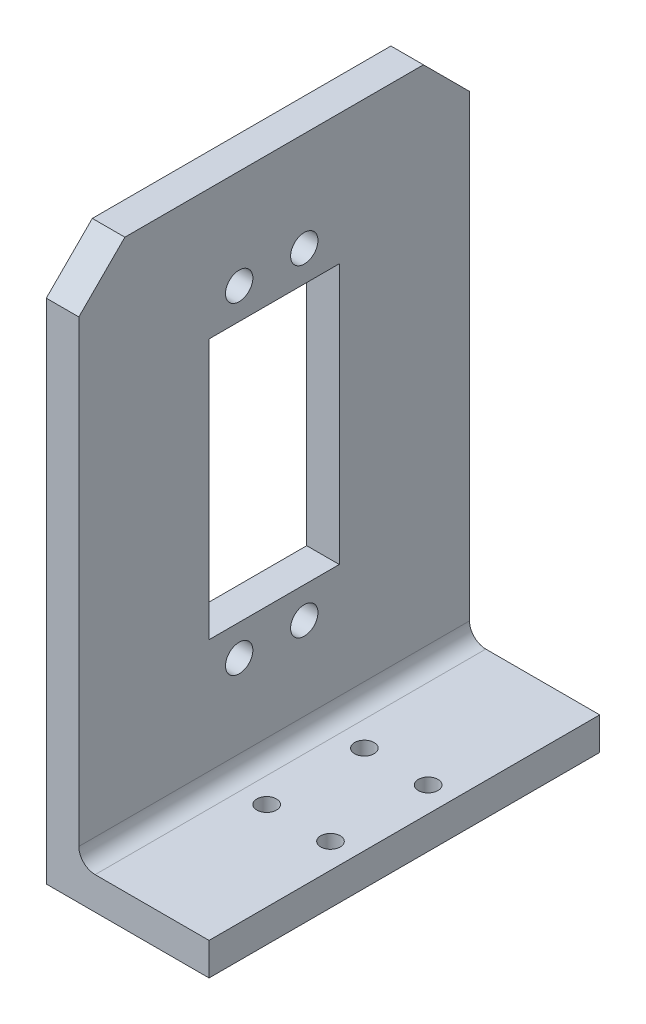
ISO-10303-21;
HEADER;
FILE_DESCRIPTION(('STEP AP214'),'2;1');
FILE_NAME('part.step','',(''),(''),'','','');
FILE_SCHEMA(('AUTOMOTIVE_DESIGN { 1 0 10303 214 1 1 1 1 }'));
ENDSEC;
DATA;
#1=APPLICATION_CONTEXT('core data for automotive mechanical design processes');
#2=APPLICATION_PROTOCOL_DEFINITION('international standard','automotive_design',2000,#1);
#3=PRODUCT_CONTEXT('',#1,'mechanical');
#4=PRODUCT('Part','Part','',(#3));
#5=PRODUCT_RELATED_PRODUCT_CATEGORY('part','',(#4));
#6=PRODUCT_DEFINITION_FORMATION('','',#4);
#7=PRODUCT_DEFINITION_CONTEXT('part definition',#1,'design');
#8=PRODUCT_DEFINITION('design','',#6,#7);
#9=PRODUCT_DEFINITION_SHAPE('','',#8);
#10=(LENGTH_UNIT() NAMED_UNIT(*) SI_UNIT(.MILLI.,.METRE.));
#11=(NAMED_UNIT(*) PLANE_ANGLE_UNIT() SI_UNIT($,.RADIAN.));
#12=(NAMED_UNIT(*) SI_UNIT($,.STERADIAN.) SOLID_ANGLE_UNIT());
#13=UNCERTAINTY_MEASURE_WITH_UNIT(LENGTH_MEASURE(1.E-05),#10,'distance_accuracy_value','');
#14=(GEOMETRIC_REPRESENTATION_CONTEXT(3) GLOBAL_UNCERTAINTY_ASSIGNED_CONTEXT((#13)) GLOBAL_UNIT_ASSIGNED_CONTEXT((#10,
#11,#12)) REPRESENTATION_CONTEXT('',''));
#15=CARTESIAN_POINT('',(0.,0.,0.));
#16=DIRECTION('',(0.,0.,1.));
#17=DIRECTION('',(1.,0.,0.));
#18=AXIS2_PLACEMENT_3D('',#15,#16,#17);
#19=CARTESIAN_POINT('',(12.5,5.,-30.));
#20=DIRECTION('',(-1.,0.,0.));
#21=DIRECTION('',(0.,0.,1.));
#22=AXIS2_PLACEMENT_3D('',#19,#20,#21);
#23=PLANE('',#22);
#24=DIRECTION('',(0.,0.,-1.));
#25=VECTOR('',#24,1.);
#26=CARTESIAN_POINT('',(12.5,0.,-30.));
#27=LINE('',#26,#25);
#28=CARTESIAN_POINT('',(12.5,0.,30.));
#29=VERTEX_POINT('',#28);
#30=CARTESIAN_POINT('',(12.5,0.,-30.));
#31=VERTEX_POINT('',#30);
#32=EDGE_CURVE('E162',#29,#31,#27,.T.);
#33=ORIENTED_EDGE('',*,*,#32,.T.);
#34=DIRECTION('',(0.,-1.,0.));
#35=VECTOR('',#34,1.);
#36=CARTESIAN_POINT('',(12.5,5.,-30.));
#37=LINE('',#36,#35);
#38=CARTESIAN_POINT('',(12.5,5.,-30.));
#39=VERTEX_POINT('',#38);
#40=EDGE_CURVE('E187',#39,#31,#37,.T.);
#41=ORIENTED_EDGE('',*,*,#40,.F.);
#42=DIRECTION('',(0.,0.,-1.));
#43=VECTOR('',#42,1.);
#44=CARTESIAN_POINT('',(12.5,5.,-30.));
#45=LINE('',#44,#43);
#46=CARTESIAN_POINT('',(12.5,5.,30.));
#47=VERTEX_POINT('',#46);
#48=EDGE_CURVE('E163',#47,#39,#45,.T.);
#49=ORIENTED_EDGE('',*,*,#48,.F.);
#50=DIRECTION('',(0.,-1.,0.));
#51=VECTOR('',#50,1.);
#52=CARTESIAN_POINT('',(12.5,5.,30.));
#53=LINE('',#52,#51);
#54=EDGE_CURVE('E171',#47,#29,#53,.T.);
#55=ORIENTED_EDGE('',*,*,#54,.T.);
#56=EDGE_LOOP('',(#33,#41,#49,#55));
#57=FACE_BOUND('',#56,.T.);
#58=ADVANCED_FACE('F35',(#57),#23,.F.);
#59=CARTESIAN_POINT('',(-12.5,5.,-30.));
#60=DIRECTION('',(0.,0.,1.));
#61=DIRECTION('',(1.,0.,0.));
#62=AXIS2_PLACEMENT_3D('',#59,#60,#61);
#63=PLANE('',#62);
#64=DIRECTION('',(0.,-1.,0.));
#65=VECTOR('',#64,1.);
#66=CARTESIAN_POINT('',(-12.5,5.,-30.));
#67=LINE('',#66,#65);
#68=CARTESIAN_POINT('',(-12.5,77.9289321881345,-30.));
#69=VERTEX_POINT('',#68);
#70=CARTESIAN_POINT('',(-12.5,0.,-30.));
#71=VERTEX_POINT('',#70);
#72=EDGE_CURVE('E185',#69,#71,#67,.T.);
#73=ORIENTED_EDGE('',*,*,#72,.F.);
#74=DIRECTION('',(1.,0.,0.));
#75=VECTOR('',#74,1.);
#76=CARTESIAN_POINT('',(-12.501,77.9289321881345,-30.));
#77=LINE('',#76,#75);
#78=CARTESIAN_POINT('',(-7.5,77.9289321881345,-30.));
#79=VERTEX_POINT('',#78);
#80=EDGE_CURVE('E138',#69,#79,#77,.T.);
#81=ORIENTED_EDGE('',*,*,#80,.T.);
#82=DIRECTION('',(0.,-1.,0.));
#83=VECTOR('',#82,1.);
#84=CARTESIAN_POINT('',(-7.5,85.,-30.));
#85=LINE('',#84,#83);
#86=CARTESIAN_POINT('',(-7.5,7.49999999999999,-30.));
#87=VERTEX_POINT('',#86);
#88=EDGE_CURVE('E148',#79,#87,#85,.T.);
#89=ORIENTED_EDGE('',*,*,#88,.T.);
#90=CARTESIAN_POINT('',(-5.,7.49999999999999,-30.));
#91=DIRECTION('',(0.,0.,1.));
#92=DIRECTION('',(1.,0.,0.));
#93=AXIS2_PLACEMENT_3D('',#90,#91,#92);
#94=CIRCLE('',#93,2.5);
#95=CARTESIAN_POINT('',(-5.,5.,-30.));
#96=VERTEX_POINT('',#95);
#97=EDGE_CURVE('E43',#87,#96,#94,.T.);
#98=ORIENTED_EDGE('',*,*,#97,.T.);
#99=DIRECTION('',(-1.,0.,0.));
#100=VECTOR('',#99,1.);
#101=CARTESIAN_POINT('',(-12.5,5.,-30.));
#102=LINE('',#101,#100);
#103=EDGE_CURVE('E166',#39,#96,#102,.T.);
#104=ORIENTED_EDGE('',*,*,#103,.F.);
#105=ORIENTED_EDGE('',*,*,#40,.T.);
#106=DIRECTION('',(-1.,0.,0.));
#107=VECTOR('',#106,1.);
#108=CARTESIAN_POINT('',(-12.5,0.,-30.));
#109=LINE('',#108,#107);
#110=EDGE_CURVE('E174',#31,#71,#109,.T.);
#111=ORIENTED_EDGE('',*,*,#110,.T.);
#112=EDGE_LOOP('',(#73,#81,#89,#98,#104,#105,#111));
#113=FACE_BOUND('',#112,.T.);
#114=ADVANCED_FACE('F197',(#113),#63,.F.);
#115=CARTESIAN_POINT('',(-12.5,5.,-30.));
#116=DIRECTION('',(1.,0.,0.));
#117=DIRECTION('',(0.,0.,-1.));
#118=AXIS2_PLACEMENT_3D('',#115,#116,#117);
#119=PLANE('',#118);
#120=CARTESIAN_POINT('',(-12.5,20.25,-4.62547229029497));
#121=DIRECTION('',(1.,0.,0.));
#122=DIRECTION('',(0.,0.,-1.));
#123=AXIS2_PLACEMENT_3D('',#120,#121,#122);
#124=CIRCLE('',#123,2.1);
#125=CARTESIAN_POINT('',(-12.5,20.25,-6.72547229029497));
#126=VERTEX_POINT('',#125);
#127=EDGE_CURVE('E201',#126,#126,#124,.F.);
#128=ORIENTED_EDGE('',*,*,#127,.F.);
#129=EDGE_LOOP('',(#128));
#130=FACE_BOUND('',#129,.T.);
#131=CARTESIAN_POINT('',(-12.5,20.25,5.37452770970503));
#132=DIRECTION('',(1.,0.,0.));
#133=DIRECTION('',(0.,0.,-1.));
#134=AXIS2_PLACEMENT_3D('',#131,#132,#133);
#135=CIRCLE('',#134,2.1);
#136=CARTESIAN_POINT('',(-12.5,20.25,3.27452770970503));
#137=VERTEX_POINT('',#136);
#138=EDGE_CURVE('E224',#137,#137,#135,.F.);
#139=ORIENTED_EDGE('',*,*,#138,.F.);
#140=EDGE_LOOP('',(#139));
#141=FACE_BOUND('',#140,.T.);
#142=CARTESIAN_POINT('',(-12.5,69.75,-4.62547229029497));
#143=DIRECTION('',(1.,0.,0.));
#144=DIRECTION('',(0.,0.,-1.));
#145=AXIS2_PLACEMENT_3D('',#142,#143,#144);
#146=CIRCLE('',#145,2.10000000000001);
#147=CARTESIAN_POINT('',(-12.5,69.75,-6.72547229029497));
#148=VERTEX_POINT('',#147);
#149=EDGE_CURVE('E217',#148,#148,#146,.F.);
#150=ORIENTED_EDGE('',*,*,#149,.F.);
#151=EDGE_LOOP('',(#150));
#152=FACE_BOUND('',#151,.T.);
#153=CARTESIAN_POINT('',(-12.5,69.75,5.37452770970503));
#154=DIRECTION('',(1.,0.,0.));
#155=DIRECTION('',(0.,0.,-1.));
#156=AXIS2_PLACEMENT_3D('',#153,#154,#155);
#157=CIRCLE('',#156,2.10000000000001);
#158=CARTESIAN_POINT('',(-12.5,69.75,3.27452770970503));
#159=VERTEX_POINT('',#158);
#160=EDGE_CURVE('E216',#159,#159,#157,.F.);
#161=ORIENTED_EDGE('',*,*,#160,.F.);
#162=EDGE_LOOP('',(#161));
#163=FACE_BOUND('',#162,.T.);
#164=DIRECTION('',(0.,0.,1.));
#165=VECTOR('',#164,1.);
#166=CARTESIAN_POINT('',(-12.5,25.,9.99999999999999));
#167=LINE('',#166,#165);
#168=CARTESIAN_POINT('',(-12.5,25.,-10.));
#169=VERTEX_POINT('',#168);
#170=CARTESIAN_POINT('',(-12.5,25.,9.99999999999999));
#171=VERTEX_POINT('',#170);
#172=EDGE_CURVE('E237',#169,#171,#167,.T.);
#173=ORIENTED_EDGE('',*,*,#172,.F.);
#174=DIRECTION('',(0.,-1.,0.));
#175=VECTOR('',#174,1.);
#176=CARTESIAN_POINT('',(-12.5,65.,-10.));
#177=LINE('',#176,#175);
#178=CARTESIAN_POINT('',(-12.5,65.,-10.));
#179=VERTEX_POINT('',#178);
#180=EDGE_CURVE('E240',#179,#169,#177,.T.);
#181=ORIENTED_EDGE('',*,*,#180,.F.);
#182=DIRECTION('',(0.,0.,-1.));
#183=VECTOR('',#182,1.);
#184=CARTESIAN_POINT('',(-12.5,65.,9.99999999999999));
#185=LINE('',#184,#183);
#186=CARTESIAN_POINT('',(-12.5,65.,9.99999999999999));
#187=VERTEX_POINT('',#186);
#188=EDGE_CURVE('E157',#187,#179,#185,.T.);
#189=ORIENTED_EDGE('',*,*,#188,.F.);
#190=DIRECTION('',(0.,1.,0.));
#191=VECTOR('',#190,1.);
#192=CARTESIAN_POINT('',(-12.5,65.,9.99999999999999));
#193=LINE('',#192,#191);
#194=EDGE_CURVE('E234',#171,#187,#193,.T.);
#195=ORIENTED_EDGE('',*,*,#194,.F.);
#196=EDGE_LOOP('',(#173,#181,#189,#195));
#197=FACE_BOUND('',#196,.T.);
#198=DIRECTION('',(0.,0.,1.));
#199=VECTOR('',#198,1.);
#200=CARTESIAN_POINT('',(-12.5,85.,-30.));
#201=LINE('',#200,#199);
#202=CARTESIAN_POINT('',(-12.5,85.,-22.9289321881345));
#203=VERTEX_POINT('',#202);
#204=CARTESIAN_POINT('',(-12.5,85.,22.9289321881345));
#205=VERTEX_POINT('',#204);
#206=EDGE_CURVE('E153',#203,#205,#201,.T.);
#207=ORIENTED_EDGE('',*,*,#206,.F.);
#208=DIRECTION('',(0.,0.707106781186546,0.707106781186549));
#209=VECTOR('',#208,1.);
#210=CARTESIAN_POINT('',(-12.5,85.,-22.9289321881345));
#211=LINE('',#210,#209);
#212=EDGE_CURVE('E133',#69,#203,#211,.T.);
#213=ORIENTED_EDGE('',*,*,#212,.F.);
#214=ORIENTED_EDGE('',*,*,#72,.T.);
#215=DIRECTION('',(0.,0.,1.));
#216=VECTOR('',#215,1.);
#217=CARTESIAN_POINT('',(-12.5,0.,-30.));
#218=LINE('',#217,#216);
#219=CARTESIAN_POINT('',(-12.5,0.,30.));
#220=VERTEX_POINT('',#219);
#221=EDGE_CURVE('E177',#71,#220,#218,.T.);
#222=ORIENTED_EDGE('',*,*,#221,.T.);
#223=DIRECTION('',(0.,-1.,0.));
#224=VECTOR('',#223,1.);
#225=CARTESIAN_POINT('',(-12.5,5.,30.));
#226=LINE('',#225,#224);
#227=CARTESIAN_POINT('',(-12.5,77.9289321881346,30.));
#228=VERTEX_POINT('',#227);
#229=EDGE_CURVE('E183',#228,#220,#226,.T.);
#230=ORIENTED_EDGE('',*,*,#229,.F.);
#231=DIRECTION('',(0.,-0.707106781186546,0.707106781186549));
#232=VECTOR('',#231,1.);
#233=CARTESIAN_POINT('',(-12.5,85.,22.9289321881345));
#234=LINE('',#233,#232);
#235=EDGE_CURVE('E205',#205,#228,#234,.T.);
#236=ORIENTED_EDGE('',*,*,#235,.F.);
#237=EDGE_LOOP('',(#207,#213,#214,#222,#230,#236));
#238=FACE_BOUND('',#237,.T.);
#239=ADVANCED_FACE('F272',(#130,#141,#152,#163,#197,#238),#119,.F.);
#240=CARTESIAN_POINT('',(-12.5,5.,30.));
#241=DIRECTION('',(0.,0.,-1.));
#242=DIRECTION('',(-1.,0.,0.));
#243=AXIS2_PLACEMENT_3D('',#240,#241,#242);
#244=PLANE('',#243);
#245=DIRECTION('',(0.,-1.,0.));
#246=VECTOR('',#245,1.);
#247=CARTESIAN_POINT('',(-7.5,85.,30.));
#248=LINE('',#247,#246);
#249=CARTESIAN_POINT('',(-7.5,77.9289321881346,30.));
#250=VERTEX_POINT('',#249);
#251=CARTESIAN_POINT('',(-7.5,7.49999999999999,30.));
#252=VERTEX_POINT('',#251);
#253=EDGE_CURVE('E155',#250,#252,#248,.T.);
#254=ORIENTED_EDGE('',*,*,#253,.F.);
#255=DIRECTION('',(1.,0.,0.));
#256=VECTOR('',#255,1.);
#257=CARTESIAN_POINT('',(-12.501,77.9289321881346,30.));
#258=LINE('',#257,#256);
#259=EDGE_CURVE('E210',#228,#250,#258,.T.);
#260=ORIENTED_EDGE('',*,*,#259,.F.);
#261=ORIENTED_EDGE('',*,*,#229,.T.);
#262=DIRECTION('',(1.,0.,0.));
#263=VECTOR('',#262,1.);
#264=CARTESIAN_POINT('',(-12.5,0.,30.));
#265=LINE('',#264,#263);
#266=EDGE_CURVE('E167',#220,#29,#265,.T.);
#267=ORIENTED_EDGE('',*,*,#266,.T.);
#268=ORIENTED_EDGE('',*,*,#54,.F.);
#269=DIRECTION('',(1.,0.,0.));
#270=VECTOR('',#269,1.);
#271=CARTESIAN_POINT('',(-12.5,5.,30.));
#272=LINE('',#271,#270);
#273=CARTESIAN_POINT('',(-5.,5.,30.));
#274=VERTEX_POINT('',#273);
#275=EDGE_CURVE('E169',#274,#47,#272,.T.);
#276=ORIENTED_EDGE('',*,*,#275,.F.);
#277=CARTESIAN_POINT('',(-5.,7.49999999999999,30.));
#278=DIRECTION('',(0.,0.,-1.));
#279=DIRECTION('',(-1.,0.,0.));
#280=AXIS2_PLACEMENT_3D('',#277,#278,#279);
#281=CIRCLE('',#280,2.5);
#282=EDGE_CURVE('E11',#274,#252,#281,.T.);
#283=ORIENTED_EDGE('',*,*,#282,.T.);
#284=EDGE_LOOP('',(#254,#260,#261,#267,#268,#276,#283));
#285=FACE_BOUND('',#284,.T.);
#286=ADVANCED_FACE('F306',(#285),#244,.F.);
#287=CARTESIAN_POINT('',(0.,5.,0.));
#288=DIRECTION('',(0.,1.,0.));
#289=DIRECTION('',(0.,0.,1.));
#290=AXIS2_PLACEMENT_3D('',#287,#288,#289);
#291=PLANE('',#290);
#292=CARTESIAN_POINT('',(8.65,5.,-7.5));
#293=DIRECTION('',(0.,1.,0.));
#294=DIRECTION('',(0.,0.,1.));
#295=AXIS2_PLACEMENT_3D('',#292,#293,#294);
#296=CIRCLE('',#295,1.5);
#297=CARTESIAN_POINT('',(8.65,5.,-6.));
#298=VERTEX_POINT('',#297);
#299=EDGE_CURVE('E317',#298,#298,#296,.T.);
#300=ORIENTED_EDGE('',*,*,#299,.F.);
#301=EDGE_LOOP('',(#300));
#302=FACE_BOUND('',#301,.T.);
#303=CARTESIAN_POINT('',(8.65,5.,7.5));
#304=DIRECTION('',(0.,1.,0.));
#305=DIRECTION('',(0.,0.,1.));
#306=AXIS2_PLACEMENT_3D('',#303,#304,#305);
#307=CIRCLE('',#306,1.5);
#308=CARTESIAN_POINT('',(8.65,5.,9.));
#309=VERTEX_POINT('',#308);
#310=EDGE_CURVE('E321',#309,#309,#307,.T.);
#311=ORIENTED_EDGE('',*,*,#310,.F.);
#312=EDGE_LOOP('',(#311));
#313=FACE_BOUND('',#312,.T.);
#314=CARTESIAN_POINT('',(-1.15,5.,-7.5));
#315=DIRECTION('',(0.,1.,0.));
#316=DIRECTION('',(0.,0.,1.));
#317=AXIS2_PLACEMENT_3D('',#314,#315,#316);
#318=CIRCLE('',#317,1.5);
#319=CARTESIAN_POINT('',(-1.15,5.,-6.));
#320=VERTEX_POINT('',#319);
#321=EDGE_CURVE('E325',#320,#320,#318,.T.);
#322=ORIENTED_EDGE('',*,*,#321,.F.);
#323=EDGE_LOOP('',(#322));
#324=FACE_BOUND('',#323,.T.);
#325=CARTESIAN_POINT('',(-1.15,5.,7.5));
#326=DIRECTION('',(0.,1.,0.));
#327=DIRECTION('',(0.,0.,1.));
#328=AXIS2_PLACEMENT_3D('',#325,#326,#327);
#329=CIRCLE('',#328,1.5);
#330=CARTESIAN_POINT('',(-1.15,5.,9.));
#331=VERTEX_POINT('',#330);
#332=EDGE_CURVE('E328',#331,#331,#329,.T.);
#333=ORIENTED_EDGE('',*,*,#332,.F.);
#334=EDGE_LOOP('',(#333));
#335=FACE_BOUND('',#334,.T.);
#336=ORIENTED_EDGE('',*,*,#103,.T.);
#337=DIRECTION('',(0.,0.,-1.));
#338=VECTOR('',#337,1.);
#339=CARTESIAN_POINT('',(-5.,5.,0.));
#340=LINE('',#339,#338);
#341=EDGE_CURVE('E56',#96,#274,#340,.F.);
#342=ORIENTED_EDGE('',*,*,#341,.T.);
#343=ORIENTED_EDGE('',*,*,#275,.T.);
#344=ORIENTED_EDGE('',*,*,#48,.T.);
#345=EDGE_LOOP('',(#336,#342,#343,#344));
#346=FACE_BOUND('',#345,.T.);
#347=ADVANCED_FACE('F291',(#302,#313,#324,#335,#346),#291,.T.);
#348=CARTESIAN_POINT('',(0.,0.,0.));
#349=DIRECTION('',(0.,1.,0.));
#350=DIRECTION('',(0.,0.,1.));
#351=AXIS2_PLACEMENT_3D('',#348,#349,#350);
#352=PLANE('',#351);
#353=CARTESIAN_POINT('',(8.65,0.,-7.5));
#354=DIRECTION('',(0.,1.,0.));
#355=DIRECTION('',(0.,0.,1.));
#356=AXIS2_PLACEMENT_3D('',#353,#354,#355);
#357=CIRCLE('',#356,1.5);
#358=CARTESIAN_POINT('',(8.65,0.,-6.));
#359=VERTEX_POINT('',#358);
#360=EDGE_CURVE('E351',#359,#359,#357,.T.);
#361=ORIENTED_EDGE('',*,*,#360,.T.);
#362=EDGE_LOOP('',(#361));
#363=FACE_BOUND('',#362,.T.);
#364=CARTESIAN_POINT('',(8.65,0.,7.5));
#365=DIRECTION('',(0.,1.,0.));
#366=DIRECTION('',(0.,0.,1.));
#367=AXIS2_PLACEMENT_3D('',#364,#365,#366);
#368=CIRCLE('',#367,1.5);
#369=CARTESIAN_POINT('',(8.65,0.,9.));
#370=VERTEX_POINT('',#369);
#371=EDGE_CURVE('E347',#370,#370,#368,.T.);
#372=ORIENTED_EDGE('',*,*,#371,.T.);
#373=EDGE_LOOP('',(#372));
#374=FACE_BOUND('',#373,.T.);
#375=CARTESIAN_POINT('',(-1.15,0.,-7.5));
#376=DIRECTION('',(0.,1.,0.));
#377=DIRECTION('',(0.,0.,1.));
#378=AXIS2_PLACEMENT_3D('',#375,#376,#377);
#379=CIRCLE('',#378,1.5);
#380=CARTESIAN_POINT('',(-1.15,0.,-6.));
#381=VERTEX_POINT('',#380);
#382=EDGE_CURVE('E343',#381,#381,#379,.T.);
#383=ORIENTED_EDGE('',*,*,#382,.T.);
#384=EDGE_LOOP('',(#383));
#385=FACE_BOUND('',#384,.T.);
#386=CARTESIAN_POINT('',(-1.15,0.,7.5));
#387=DIRECTION('',(0.,1.,0.));
#388=DIRECTION('',(0.,0.,1.));
#389=AXIS2_PLACEMENT_3D('',#386,#387,#388);
#390=CIRCLE('',#389,1.5);
#391=CARTESIAN_POINT('',(-1.15,0.,9.));
#392=VERTEX_POINT('',#391);
#393=EDGE_CURVE('E208',#392,#392,#390,.T.);
#394=ORIENTED_EDGE('',*,*,#393,.T.);
#395=EDGE_LOOP('',(#394));
#396=FACE_BOUND('',#395,.T.);
#397=ORIENTED_EDGE('',*,*,#32,.F.);
#398=ORIENTED_EDGE('',*,*,#266,.F.);
#399=ORIENTED_EDGE('',*,*,#221,.F.);
#400=ORIENTED_EDGE('',*,*,#110,.F.);
#401=EDGE_LOOP('',(#397,#398,#399,#400));
#402=FACE_BOUND('',#401,.T.);
#403=ADVANCED_FACE('F283',(#363,#374,#385,#396,#402),#352,.F.);
#404=CARTESIAN_POINT('',(-7.5,85.,-30.));
#405=DIRECTION('',(-1.,0.,0.));
#406=DIRECTION('',(0.,0.,1.));
#407=AXIS2_PLACEMENT_3D('',#404,#405,#406);
#408=PLANE('',#407);
#409=CARTESIAN_POINT('',(-7.5,20.25,-4.62547229029497));
#410=DIRECTION('',(1.,0.,0.));
#411=DIRECTION('',(0.,0.,-1.));
#412=AXIS2_PLACEMENT_3D('',#409,#410,#411);
#413=CIRCLE('',#412,2.1);
#414=CARTESIAN_POINT('',(-7.5,20.25,-6.72547229029497));
#415=VERTEX_POINT('',#414);
#416=EDGE_CURVE('E198',#415,#415,#413,.T.);
#417=ORIENTED_EDGE('',*,*,#416,.F.);
#418=EDGE_LOOP('',(#417));
#419=FACE_BOUND('',#418,.T.);
#420=CARTESIAN_POINT('',(-7.5,20.25,5.37452770970503));
#421=DIRECTION('',(1.,0.,0.));
#422=DIRECTION('',(0.,0.,-1.));
#423=AXIS2_PLACEMENT_3D('',#420,#421,#422);
#424=CIRCLE('',#423,2.1);
#425=CARTESIAN_POINT('',(-7.5,20.25,3.27452770970503));
#426=VERTEX_POINT('',#425);
#427=EDGE_CURVE('E227',#426,#426,#424,.T.);
#428=ORIENTED_EDGE('',*,*,#427,.F.);
#429=EDGE_LOOP('',(#428));
#430=FACE_BOUND('',#429,.T.);
#431=CARTESIAN_POINT('',(-7.5,69.75,-4.62547229029497));
#432=DIRECTION('',(1.,0.,0.));
#433=DIRECTION('',(0.,0.,-1.));
#434=AXIS2_PLACEMENT_3D('',#431,#432,#433);
#435=CIRCLE('',#434,2.10000000000001);
#436=CARTESIAN_POINT('',(-7.5,69.75,-6.72547229029497));
#437=VERTEX_POINT('',#436);
#438=EDGE_CURVE('E221',#437,#437,#435,.T.);
#439=ORIENTED_EDGE('',*,*,#438,.F.);
#440=EDGE_LOOP('',(#439));
#441=FACE_BOUND('',#440,.T.);
#442=CARTESIAN_POINT('',(-7.5,69.75,5.37452770970503));
#443=DIRECTION('',(1.,0.,0.));
#444=DIRECTION('',(0.,0.,-1.));
#445=AXIS2_PLACEMENT_3D('',#442,#443,#444);
#446=CIRCLE('',#445,2.10000000000001);
#447=CARTESIAN_POINT('',(-7.5,69.75,3.27452770970503));
#448=VERTEX_POINT('',#447);
#449=EDGE_CURVE('E213',#448,#448,#446,.T.);
#450=ORIENTED_EDGE('',*,*,#449,.F.);
#451=EDGE_LOOP('',(#450));
#452=FACE_BOUND('',#451,.T.);
#453=DIRECTION('',(0.,0.,1.));
#454=VECTOR('',#453,1.);
#455=CARTESIAN_POINT('',(-7.5,65.,9.99999999999999));
#456=LINE('',#455,#454);
#457=CARTESIAN_POINT('',(-7.5,65.,-10.));
#458=VERTEX_POINT('',#457);
#459=CARTESIAN_POINT('',(-7.5,65.,9.99999999999999));
#460=VERTEX_POINT('',#459);
#461=EDGE_CURVE('E243',#458,#460,#456,.T.);
#462=ORIENTED_EDGE('',*,*,#461,.F.);
#463=DIRECTION('',(0.,1.,0.));
#464=VECTOR('',#463,1.);
#465=CARTESIAN_POINT('',(-7.5,65.,-10.));
#466=LINE('',#465,#464);
#467=CARTESIAN_POINT('',(-7.5,25.,-10.));
#468=VERTEX_POINT('',#467);
#469=EDGE_CURVE('E220',#468,#458,#466,.T.);
#470=ORIENTED_EDGE('',*,*,#469,.F.);
#471=DIRECTION('',(0.,0.,-1.));
#472=VECTOR('',#471,1.);
#473=CARTESIAN_POINT('',(-7.5,25.,9.99999999999999));
#474=LINE('',#473,#472);
#475=CARTESIAN_POINT('',(-7.5,25.,9.99999999999999));
#476=VERTEX_POINT('',#475);
#477=EDGE_CURVE('E249',#476,#468,#474,.T.);
#478=ORIENTED_EDGE('',*,*,#477,.F.);
#479=DIRECTION('',(0.,-1.,0.));
#480=VECTOR('',#479,1.);
#481=CARTESIAN_POINT('',(-7.5,65.,9.99999999999999));
#482=LINE('',#481,#480);
#483=EDGE_CURVE('E246',#460,#476,#482,.T.);
#484=ORIENTED_EDGE('',*,*,#483,.F.);
#485=EDGE_LOOP('',(#462,#470,#478,#484));
#486=FACE_BOUND('',#485,.T.);
#487=ORIENTED_EDGE('',*,*,#253,.T.);
#488=DIRECTION('',(0.,0.,-1.));
#489=VECTOR('',#488,1.);
#490=CARTESIAN_POINT('',(-7.5,7.49999999999999,-30.));
#491=LINE('',#490,#489);
#492=EDGE_CURVE('E190',#252,#87,#491,.T.);
#493=ORIENTED_EDGE('',*,*,#492,.T.);
#494=ORIENTED_EDGE('',*,*,#88,.F.);
#495=DIRECTION('',(0.,-0.707106781186546,-0.707106781186549));
#496=VECTOR('',#495,1.);
#497=CARTESIAN_POINT('',(-7.5,85.,-22.9289321881345));
#498=LINE('',#497,#496);
#499=CARTESIAN_POINT('',(-7.5,85.,-22.9289321881345));
#500=VERTEX_POINT('',#499);
#501=EDGE_CURVE('E130',#500,#79,#498,.T.);
#502=ORIENTED_EDGE('',*,*,#501,.F.);
#503=DIRECTION('',(0.,0.,-1.));
#504=VECTOR('',#503,1.);
#505=CARTESIAN_POINT('',(-7.5,85.,-30.));
#506=LINE('',#505,#504);
#507=CARTESIAN_POINT('',(-7.5,85.,22.9289321881345));
#508=VERTEX_POINT('',#507);
#509=EDGE_CURVE('E146',#508,#500,#506,.T.);
#510=ORIENTED_EDGE('',*,*,#509,.F.);
#511=DIRECTION('',(0.,0.707106781186546,-0.707106781186549));
#512=VECTOR('',#511,1.);
#513=CARTESIAN_POINT('',(-7.5,85.,22.9289321881345));
#514=LINE('',#513,#512);
#515=EDGE_CURVE('E207',#250,#508,#514,.T.);
#516=ORIENTED_EDGE('',*,*,#515,.F.);
#517=EDGE_LOOP('',(#487,#493,#494,#502,#510,#516));
#518=FACE_BOUND('',#517,.T.);
#519=ADVANCED_FACE('F144',(#419,#430,#441,#452,#486,#518),#408,.F.);
#520=CARTESIAN_POINT('',(0.,85.,0.));
#521=DIRECTION('',(0.,1.,0.));
#522=DIRECTION('',(0.,0.,1.));
#523=AXIS2_PLACEMENT_3D('',#520,#521,#522);
#524=PLANE('',#523);
#525=DIRECTION('',(1.,0.,0.));
#526=VECTOR('',#525,1.);
#527=CARTESIAN_POINT('',(-12.501,85.,-22.9289321881345));
#528=LINE('',#527,#526);
#529=EDGE_CURVE('E127',#203,#500,#528,.T.);
#530=ORIENTED_EDGE('',*,*,#529,.F.);
#531=ORIENTED_EDGE('',*,*,#206,.T.);
#532=DIRECTION('',(1.,0.,0.));
#533=VECTOR('',#532,1.);
#534=CARTESIAN_POINT('',(-12.501,85.,22.9289321881345));
#535=LINE('',#534,#533);
#536=EDGE_CURVE('E152',#205,#508,#535,.T.);
#537=ORIENTED_EDGE('',*,*,#536,.T.);
#538=ORIENTED_EDGE('',*,*,#509,.T.);
#539=EDGE_LOOP('',(#530,#531,#537,#538));
#540=FACE_BOUND('',#539,.T.);
#541=ADVANCED_FACE('F151',(#540),#524,.T.);
#542=CARTESIAN_POINT('',(-57.2213595499958,65.,-10.));
#543=DIRECTION('',(0.,0.,-1.));
#544=DIRECTION('',(0.,1.,0.));
#545=AXIS2_PLACEMENT_3D('',#542,#543,#544);
#546=PLANE('',#545);
#547=ORIENTED_EDGE('',*,*,#180,.T.);
#548=DIRECTION('',(1.,0.,0.));
#549=VECTOR('',#548,1.);
#550=CARTESIAN_POINT('',(-57.2213595499958,25.,-10.));
#551=LINE('',#550,#549);
#552=EDGE_CURVE('E238',#169,#468,#551,.T.);
#553=ORIENTED_EDGE('',*,*,#552,.T.);
#554=ORIENTED_EDGE('',*,*,#469,.T.);
#555=DIRECTION('',(1.,0.,0.));
#556=VECTOR('',#555,1.);
#557=CARTESIAN_POINT('',(-57.2213595499958,65.,-10.));
#558=LINE('',#557,#556);
#559=EDGE_CURVE('E252',#179,#458,#558,.T.);
#560=ORIENTED_EDGE('',*,*,#559,.F.);
#561=EDGE_LOOP('',(#547,#553,#554,#560));
#562=FACE_BOUND('',#561,.T.);
#563=ADVANCED_FACE('F268',(#562),#546,.F.);
#564=CARTESIAN_POINT('',(-57.2213595499958,25.,9.99999999999999));
#565=DIRECTION('',(0.,-1.,0.));
#566=DIRECTION('',(0.,0.,-1.));
#567=AXIS2_PLACEMENT_3D('',#564,#565,#566);
#568=PLANE('',#567);
#569=ORIENTED_EDGE('',*,*,#172,.T.);
#570=DIRECTION('',(1.,0.,0.));
#571=VECTOR('',#570,1.);
#572=CARTESIAN_POINT('',(-57.2213595499958,25.,9.99999999999999));
#573=LINE('',#572,#571);
#574=EDGE_CURVE('E254',#171,#476,#573,.T.);
#575=ORIENTED_EDGE('',*,*,#574,.T.);
#576=ORIENTED_EDGE('',*,*,#477,.T.);
#577=ORIENTED_EDGE('',*,*,#552,.F.);
#578=EDGE_LOOP('',(#569,#575,#576,#577));
#579=FACE_BOUND('',#578,.T.);
#580=ADVANCED_FACE('F276',(#579),#568,.F.);
#581=CARTESIAN_POINT('',(-57.2213595499958,65.,10.));
#582=DIRECTION('',(0.,0.,1.));
#583=DIRECTION('',(0.,-1.,0.));
#584=AXIS2_PLACEMENT_3D('',#581,#582,#583);
#585=PLANE('',#584);
#586=ORIENTED_EDGE('',*,*,#194,.T.);
#587=DIRECTION('',(1.,0.,0.));
#588=VECTOR('',#587,1.);
#589=CARTESIAN_POINT('',(-57.2213595499958,65.,10.));
#590=LINE('',#589,#588);
#591=EDGE_CURVE('E256',#187,#460,#590,.T.);
#592=ORIENTED_EDGE('',*,*,#591,.T.);
#593=ORIENTED_EDGE('',*,*,#483,.T.);
#594=ORIENTED_EDGE('',*,*,#574,.F.);
#595=EDGE_LOOP('',(#586,#592,#593,#594));
#596=FACE_BOUND('',#595,.T.);
#597=ADVANCED_FACE('F278',(#596),#585,.F.);
#598=CARTESIAN_POINT('',(-57.2213595499958,65.,10.));
#599=DIRECTION('',(0.,1.,0.));
#600=DIRECTION('',(0.,0.,1.));
#601=AXIS2_PLACEMENT_3D('',#598,#599,#600);
#602=PLANE('',#601);
#603=ORIENTED_EDGE('',*,*,#188,.T.);
#604=ORIENTED_EDGE('',*,*,#559,.T.);
#605=ORIENTED_EDGE('',*,*,#461,.T.);
#606=ORIENTED_EDGE('',*,*,#591,.F.);
#607=EDGE_LOOP('',(#603,#604,#605,#606));
#608=FACE_BOUND('',#607,.T.);
#609=ADVANCED_FACE('F262',(#608),#602,.F.);
#610=CARTESIAN_POINT('',(-57.2213595499958,69.75,5.37452770970504));
#611=DIRECTION('',(1.,0.,0.));
#612=DIRECTION('',(0.,0.,-1.));
#613=AXIS2_PLACEMENT_3D('',#610,#611,#612);
#614=CYLINDRICAL_SURFACE('',#613,2.10000000000001);
#615=ORIENTED_EDGE('',*,*,#160,.T.);
#616=EDGE_LOOP('',(#615));
#617=FACE_BOUND('',#616,.T.);
#618=ORIENTED_EDGE('',*,*,#449,.T.);
#619=EDGE_LOOP('',(#618));
#620=FACE_BOUND('',#619,.T.);
#621=ADVANCED_FACE('F382',(#617,#620),#614,.F.);
#622=CARTESIAN_POINT('',(-57.2213595499958,69.75,-4.62547229029496));
#623=DIRECTION('',(1.,0.,0.));
#624=DIRECTION('',(0.,0.,-1.));
#625=AXIS2_PLACEMENT_3D('',#622,#623,#624);
#626=CYLINDRICAL_SURFACE('',#625,2.10000000000001);
#627=ORIENTED_EDGE('',*,*,#149,.T.);
#628=EDGE_LOOP('',(#627));
#629=FACE_BOUND('',#628,.T.);
#630=ORIENTED_EDGE('',*,*,#438,.T.);
#631=EDGE_LOOP('',(#630));
#632=FACE_BOUND('',#631,.T.);
#633=ADVANCED_FACE('F385',(#629,#632),#626,.F.);
#634=CARTESIAN_POINT('',(-57.2213595499958,20.25,5.37452770970504));
#635=DIRECTION('',(1.,0.,0.));
#636=DIRECTION('',(0.,0.,-1.));
#637=AXIS2_PLACEMENT_3D('',#634,#635,#636);
#638=CYLINDRICAL_SURFACE('',#637,2.1);
#639=ORIENTED_EDGE('',*,*,#138,.T.);
#640=EDGE_LOOP('',(#639));
#641=FACE_BOUND('',#640,.T.);
#642=ORIENTED_EDGE('',*,*,#427,.T.);
#643=EDGE_LOOP('',(#642));
#644=FACE_BOUND('',#643,.T.);
#645=ADVANCED_FACE('F389',(#641,#644),#638,.F.);
#646=CARTESIAN_POINT('',(-57.2213595499958,20.25,-4.62547229029496));
#647=DIRECTION('',(1.,0.,0.));
#648=DIRECTION('',(0.,0.,-1.));
#649=AXIS2_PLACEMENT_3D('',#646,#647,#648);
#650=CYLINDRICAL_SURFACE('',#649,2.1);
#651=ORIENTED_EDGE('',*,*,#127,.T.);
#652=EDGE_LOOP('',(#651));
#653=FACE_BOUND('',#652,.T.);
#654=ORIENTED_EDGE('',*,*,#416,.T.);
#655=EDGE_LOOP('',(#654));
#656=FACE_BOUND('',#655,.T.);
#657=ADVANCED_FACE('F380',(#653,#656),#650,.F.);
#658=CARTESIAN_POINT('',(-12.501,85.,22.9289321881345));
#659=DIRECTION('',(0.,-0.707106781186549,-0.707106781186546));
#660=DIRECTION('',(0.,0.707106781186546,-0.707106781186549));
#661=AXIS2_PLACEMENT_3D('',#658,#659,#660);
#662=PLANE('',#661);
#663=ORIENTED_EDGE('',*,*,#235,.T.);
#664=ORIENTED_EDGE('',*,*,#259,.T.);
#665=ORIENTED_EDGE('',*,*,#515,.T.);
#666=ORIENTED_EDGE('',*,*,#536,.F.);
#667=EDGE_LOOP('',(#663,#664,#665,#666));
#668=FACE_BOUND('',#667,.T.);
#669=ADVANCED_FACE('F377',(#668),#662,.F.);
#670=CARTESIAN_POINT('',(-12.501,85.,-22.9289321881345));
#671=DIRECTION('',(0.,-0.707106781186549,0.707106781186546));
#672=DIRECTION('',(0.,-0.707106781186546,-0.707106781186549));
#673=AXIS2_PLACEMENT_3D('',#670,#671,#672);
#674=PLANE('',#673);
#675=ORIENTED_EDGE('',*,*,#212,.T.);
#676=ORIENTED_EDGE('',*,*,#529,.T.);
#677=ORIENTED_EDGE('',*,*,#501,.T.);
#678=ORIENTED_EDGE('',*,*,#80,.F.);
#679=EDGE_LOOP('',(#675,#676,#677,#678));
#680=FACE_BOUND('',#679,.T.);
#681=ADVANCED_FACE('F129',(#680),#674,.F.);
#682=CARTESIAN_POINT('',(-5.,7.49999999999999,-30.));
#683=DIRECTION('',(0.,0.,-1.));
#684=DIRECTION('',(-1.,0.,0.));
#685=AXIS2_PLACEMENT_3D('',#682,#683,#684);
#686=CYLINDRICAL_SURFACE('',#685,2.5);
#687=ORIENTED_EDGE('',*,*,#282,.F.);
#688=ORIENTED_EDGE('',*,*,#341,.F.);
#689=ORIENTED_EDGE('',*,*,#97,.F.);
#690=ORIENTED_EDGE('',*,*,#492,.F.);
#691=EDGE_LOOP('',(#687,#688,#689,#690));
#692=FACE_BOUND('',#691,.T.);
#693=ADVANCED_FACE('F37',(#692),#686,.F.);
#694=CARTESIAN_POINT('',(-1.15,5.,7.5));
#695=DIRECTION('',(0.,1.,0.));
#696=DIRECTION('',(0.,0.,1.));
#697=AXIS2_PLACEMENT_3D('',#694,#695,#696);
#698=CYLINDRICAL_SURFACE('',#697,1.5);
#699=ORIENTED_EDGE('',*,*,#393,.F.);
#700=EDGE_LOOP('',(#699));
#701=FACE_BOUND('',#700,.T.);
#702=ORIENTED_EDGE('',*,*,#332,.T.);
#703=EDGE_LOOP('',(#702));
#704=FACE_BOUND('',#703,.T.);
#705=ADVANCED_FACE('F370',(#701,#704),#698,.F.);
#706=CARTESIAN_POINT('',(-1.15,5.,-7.5));
#707=DIRECTION('',(0.,1.,0.));
#708=DIRECTION('',(0.,0.,1.));
#709=AXIS2_PLACEMENT_3D('',#706,#707,#708);
#710=CYLINDRICAL_SURFACE('',#709,1.5);
#711=ORIENTED_EDGE('',*,*,#382,.F.);
#712=EDGE_LOOP('',(#711));
#713=FACE_BOUND('',#712,.T.);
#714=ORIENTED_EDGE('',*,*,#321,.T.);
#715=EDGE_LOOP('',(#714));
#716=FACE_BOUND('',#715,.T.);
#717=ADVANCED_FACE('F363',(#713,#716),#710,.F.);
#718=CARTESIAN_POINT('',(8.65,5.,7.5));
#719=DIRECTION('',(0.,1.,0.));
#720=DIRECTION('',(0.,0.,1.));
#721=AXIS2_PLACEMENT_3D('',#718,#719,#720);
#722=CYLINDRICAL_SURFACE('',#721,1.5);
#723=ORIENTED_EDGE('',*,*,#371,.F.);
#724=EDGE_LOOP('',(#723));
#725=FACE_BOUND('',#724,.T.);
#726=ORIENTED_EDGE('',*,*,#310,.T.);
#727=EDGE_LOOP('',(#726));
#728=FACE_BOUND('',#727,.T.);
#729=ADVANCED_FACE('F357',(#725,#728),#722,.F.);
#730=CARTESIAN_POINT('',(8.65,5.,-7.5));
#731=DIRECTION('',(0.,1.,0.));
#732=DIRECTION('',(0.,0.,1.));
#733=AXIS2_PLACEMENT_3D('',#730,#731,#732);
#734=CYLINDRICAL_SURFACE('',#733,1.5);
#735=ORIENTED_EDGE('',*,*,#360,.F.);
#736=EDGE_LOOP('',(#735));
#737=FACE_BOUND('',#736,.T.);
#738=ORIENTED_EDGE('',*,*,#299,.T.);
#739=EDGE_LOOP('',(#738));
#740=FACE_BOUND('',#739,.T.);
#741=ADVANCED_FACE('F355',(#737,#740),#734,.F.);
#742=CLOSED_SHELL('',(#58,#114,#239,#286,#347,#403,#519,#541,#563,#580,#597,#609,#621,#633,#645,
#657,#669,#681,#693,#705,#717,#729,#741));
#743=MANIFOLD_SOLID_BREP('B2',#742);
#744=ADVANCED_BREP_SHAPE_REPRESENTATION('',(#18,#743),#14);
#745=SHAPE_DEFINITION_REPRESENTATION(#9,#744);
ENDSEC;
END-ISO-10303-21;
